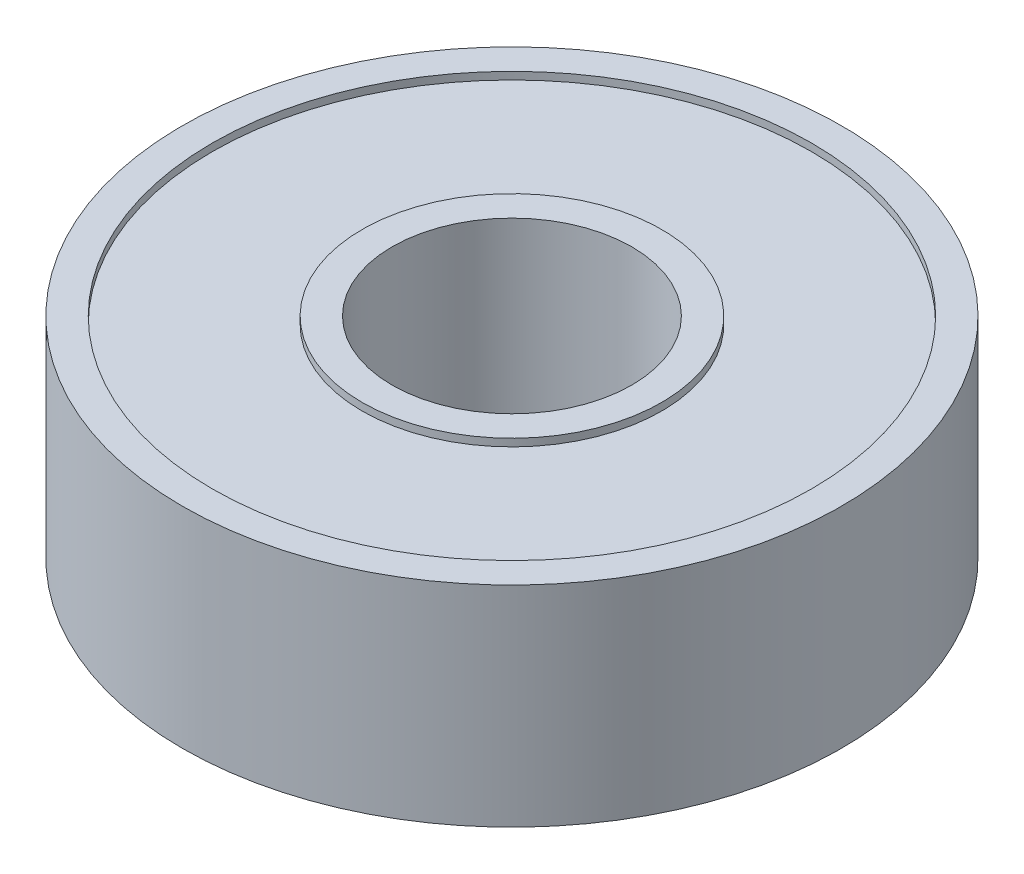
ISO-10303-21;
HEADER;
FILE_DESCRIPTION(('STEP AP214'),'2;1');
FILE_NAME('part.step','',(''),(''),'','','');
FILE_SCHEMA(('AUTOMOTIVE_DESIGN { 1 0 10303 214 1 1 1 1 }'));
ENDSEC;
DATA;
#1=APPLICATION_CONTEXT('core data for automotive mechanical design processes');
#2=APPLICATION_PROTOCOL_DEFINITION('international standard','automotive_design',2000,#1);
#3=PRODUCT_CONTEXT('',#1,'mechanical');
#4=PRODUCT('Part','Part','',(#3));
#5=PRODUCT_RELATED_PRODUCT_CATEGORY('part','',(#4));
#6=PRODUCT_DEFINITION_FORMATION('','',#4);
#7=PRODUCT_DEFINITION_CONTEXT('part definition',#1,'design');
#8=PRODUCT_DEFINITION('design','',#6,#7);
#9=PRODUCT_DEFINITION_SHAPE('','',#8);
#10=(LENGTH_UNIT() NAMED_UNIT(*) SI_UNIT(.MILLI.,.METRE.));
#11=(NAMED_UNIT(*) PLANE_ANGLE_UNIT() SI_UNIT($,.RADIAN.));
#12=(NAMED_UNIT(*) SI_UNIT($,.STERADIAN.) SOLID_ANGLE_UNIT());
#13=UNCERTAINTY_MEASURE_WITH_UNIT(LENGTH_MEASURE(1.E-05),#10,'distance_accuracy_value','');
#14=(GEOMETRIC_REPRESENTATION_CONTEXT(3) GLOBAL_UNCERTAINTY_ASSIGNED_CONTEXT((#13)) GLOBAL_UNIT_ASSIGNED_CONTEXT((#10,
#11,#12)) REPRESENTATION_CONTEXT('',''));
#15=CARTESIAN_POINT('',(0.,0.,0.));
#16=DIRECTION('',(0.,0.,1.));
#17=DIRECTION('',(1.,0.,0.));
#18=AXIS2_PLACEMENT_3D('',#15,#16,#17);
#19=CARTESIAN_POINT('',(0.,0.,0.));
#20=DIRECTION('',(0.,1.,0.));
#21=DIRECTION('',(0.,0.,1.));
#22=AXIS2_PLACEMENT_3D('',#19,#20,#21);
#23=PLANE('',#22);
#24=CARTESIAN_POINT('',(0.,0.,0.));
#25=DIRECTION('',(0.,1.,0.));
#26=DIRECTION('',(0.,0.,1.));
#27=AXIS2_PLACEMENT_3D('',#24,#25,#26);
#28=CIRCLE('',#27,4.);
#29=CARTESIAN_POINT('',(0.,0.,4.));
#30=VERTEX_POINT('',#29);
#31=EDGE_CURVE('E47',#30,#30,#28,.T.);
#32=ORIENTED_EDGE('',*,*,#31,.T.);
#33=EDGE_LOOP('',(#32));
#34=FACE_BOUND('',#33,.T.);
#35=CARTESIAN_POINT('',(0.,0.,0.));
#36=DIRECTION('',(0.,1.,0.));
#37=DIRECTION('',(0.,0.,1.));
#38=AXIS2_PLACEMENT_3D('',#35,#36,#37);
#39=CIRCLE('',#38,5.);
#40=CARTESIAN_POINT('',(0.,0.,5.));
#41=VERTEX_POINT('',#40);
#42=EDGE_CURVE('E71',#41,#41,#39,.T.);
#43=ORIENTED_EDGE('',*,*,#42,.F.);
#44=EDGE_LOOP('',(#43));
#45=FACE_BOUND('',#44,.T.);
#46=ADVANCED_FACE('F34',(#34,#45),#23,.F.);
#47=CARTESIAN_POINT('',(0.,7.,0.));
#48=DIRECTION('',(0.,1.,0.));
#49=DIRECTION('',(0.,0.,1.));
#50=AXIS2_PLACEMENT_3D('',#47,#48,#49);
#51=PLANE('',#50);
#52=CARTESIAN_POINT('',(0.,7.,0.));
#53=DIRECTION('',(0.,1.,0.));
#54=DIRECTION('',(0.,0.,1.));
#55=AXIS2_PLACEMENT_3D('',#52,#53,#54);
#56=CIRCLE('',#55,4.);
#57=CARTESIAN_POINT('',(0.,7.,4.));
#58=VERTEX_POINT('',#57);
#59=EDGE_CURVE('E45',#58,#58,#56,.T.);
#60=ORIENTED_EDGE('',*,*,#59,.F.);
#61=EDGE_LOOP('',(#60));
#62=FACE_BOUND('',#61,.T.);
#63=CARTESIAN_POINT('',(0.,7.,0.));
#64=DIRECTION('',(0.,1.,0.));
#65=DIRECTION('',(0.,0.,1.));
#66=AXIS2_PLACEMENT_3D('',#63,#64,#65);
#67=CIRCLE('',#66,5.);
#68=CARTESIAN_POINT('',(0.,7.,5.));
#69=VERTEX_POINT('',#68);
#70=EDGE_CURVE('E59',#69,#69,#67,.T.);
#71=ORIENTED_EDGE('',*,*,#70,.T.);
#72=EDGE_LOOP('',(#71));
#73=FACE_BOUND('',#72,.T.);
#74=ADVANCED_FACE('F87',(#62,#73),#51,.T.);
#75=CARTESIAN_POINT('',(0.,7.,0.));
#76=DIRECTION('',(0.,1.,0.));
#77=DIRECTION('',(0.,0.,1.));
#78=AXIS2_PLACEMENT_3D('',#75,#76,#77);
#79=CIRCLE('',#78,10.);
#80=CARTESIAN_POINT('',(0.,7.,10.));
#81=VERTEX_POINT('',#80);
#82=EDGE_CURVE('E53',#81,#81,#79,.T.);
#83=ORIENTED_EDGE('',*,*,#82,.F.);
#84=EDGE_LOOP('',(#83));
#85=FACE_BOUND('',#84,.T.);
#86=CARTESIAN_POINT('',(0.,7.,0.));
#87=DIRECTION('',(0.,1.,0.));
#88=DIRECTION('',(0.,0.,1.));
#89=AXIS2_PLACEMENT_3D('',#86,#87,#88);
#90=CIRCLE('',#89,11.);
#91=CARTESIAN_POINT('',(0.,7.,11.));
#92=VERTEX_POINT('',#91);
#93=EDGE_CURVE('E10',#92,#92,#90,.T.);
#94=ORIENTED_EDGE('',*,*,#93,.T.);
#95=EDGE_LOOP('',(#94));
#96=FACE_BOUND('',#95,.T.);
#97=ADVANCED_FACE('F93',(#85,#96),#51,.T.);
#98=CARTESIAN_POINT('',(0.,0.,0.));
#99=DIRECTION('',(0.,1.,0.));
#100=DIRECTION('',(0.,0.,1.));
#101=AXIS2_PLACEMENT_3D('',#98,#99,#100);
#102=CIRCLE('',#101,10.);
#103=CARTESIAN_POINT('',(0.,0.,10.));
#104=VERTEX_POINT('',#103);
#105=EDGE_CURVE('E65',#104,#104,#102,.T.);
#106=ORIENTED_EDGE('',*,*,#105,.T.);
#107=EDGE_LOOP('',(#106));
#108=FACE_BOUND('',#107,.T.);
#109=CARTESIAN_POINT('',(0.,0.,0.));
#110=DIRECTION('',(0.,1.,0.));
#111=DIRECTION('',(0.,0.,1.));
#112=AXIS2_PLACEMENT_3D('',#109,#110,#111);
#113=CIRCLE('',#112,11.);
#114=CARTESIAN_POINT('',(0.,0.,11.));
#115=VERTEX_POINT('',#114);
#116=EDGE_CURVE('E38',#115,#115,#113,.T.);
#117=ORIENTED_EDGE('',*,*,#116,.F.);
#118=EDGE_LOOP('',(#117));
#119=FACE_BOUND('',#118,.T.);
#120=ADVANCED_FACE('F89',(#108,#119),#23,.F.);
#121=CARTESIAN_POINT('',(0.,7.,0.));
#122=DIRECTION('',(0.,-1.,0.));
#123=DIRECTION('',(0.,0.,-1.));
#124=AXIS2_PLACEMENT_3D('',#121,#122,#123);
#125=CYLINDRICAL_SURFACE('',#124,11.);
#126=ORIENTED_EDGE('',*,*,#93,.F.);
#127=EDGE_LOOP('',(#126));
#128=FACE_BOUND('',#127,.T.);
#129=ORIENTED_EDGE('',*,*,#116,.T.);
#130=EDGE_LOOP('',(#129));
#131=FACE_BOUND('',#130,.T.);
#132=ADVANCED_FACE('F36',(#128,#131),#125,.T.);
#133=CARTESIAN_POINT('',(0.,7.,0.));
#134=DIRECTION('',(0.,-1.,0.));
#135=DIRECTION('',(0.,0.,-1.));
#136=AXIS2_PLACEMENT_3D('',#133,#134,#135);
#137=CYLINDRICAL_SURFACE('',#136,4.);
#138=ORIENTED_EDGE('',*,*,#59,.T.);
#139=EDGE_LOOP('',(#138));
#140=FACE_BOUND('',#139,.T.);
#141=ORIENTED_EDGE('',*,*,#31,.F.);
#142=EDGE_LOOP('',(#141));
#143=FACE_BOUND('',#142,.T.);
#144=ADVANCED_FACE('F102',(#140,#143),#137,.F.);
#145=CARTESIAN_POINT('',(0.,6.75,0.));
#146=DIRECTION('',(0.,1.,0.));
#147=DIRECTION('',(0.,0.,1.));
#148=AXIS2_PLACEMENT_3D('',#145,#146,#147);
#149=CYLINDRICAL_SURFACE('',#148,10.);
#150=CARTESIAN_POINT('',(0.,6.75,0.));
#151=DIRECTION('',(0.,1.,0.));
#152=DIRECTION('',(0.,0.,1.));
#153=AXIS2_PLACEMENT_3D('',#150,#151,#152);
#154=CIRCLE('',#153,10.);
#155=CARTESIAN_POINT('',(0.,6.75,10.));
#156=VERTEX_POINT('',#155);
#157=EDGE_CURVE('E50',#156,#156,#154,.T.);
#158=ORIENTED_EDGE('',*,*,#157,.F.);
#159=EDGE_LOOP('',(#158));
#160=FACE_BOUND('',#159,.T.);
#161=ORIENTED_EDGE('',*,*,#82,.T.);
#162=EDGE_LOOP('',(#161));
#163=FACE_BOUND('',#162,.T.);
#164=ADVANCED_FACE('F126',(#160,#163),#149,.F.);
#165=CARTESIAN_POINT('',(0.,6.75,0.));
#166=DIRECTION('',(0.,1.,0.));
#167=DIRECTION('',(0.,0.,1.));
#168=AXIS2_PLACEMENT_3D('',#165,#166,#167);
#169=PLANE('',#168);
#170=CARTESIAN_POINT('',(0.,6.75,0.));
#171=DIRECTION('',(0.,1.,0.));
#172=DIRECTION('',(0.,0.,1.));
#173=AXIS2_PLACEMENT_3D('',#170,#171,#172);
#174=CIRCLE('',#173,5.);
#175=CARTESIAN_POINT('',(0.,6.75,5.));
#176=VERTEX_POINT('',#175);
#177=EDGE_CURVE('E56',#176,#176,#174,.T.);
#178=ORIENTED_EDGE('',*,*,#177,.F.);
#179=EDGE_LOOP('',(#178));
#180=FACE_BOUND('',#179,.T.);
#181=ORIENTED_EDGE('',*,*,#157,.T.);
#182=EDGE_LOOP('',(#181));
#183=FACE_BOUND('',#182,.T.);
#184=ADVANCED_FACE('F122',(#180,#183),#169,.T.);
#185=CARTESIAN_POINT('',(0.,6.75,0.));
#186=DIRECTION('',(0.,1.,0.));
#187=DIRECTION('',(0.,0.,1.));
#188=AXIS2_PLACEMENT_3D('',#185,#186,#187);
#189=CYLINDRICAL_SURFACE('',#188,5.);
#190=ORIENTED_EDGE('',*,*,#177,.T.);
#191=EDGE_LOOP('',(#190));
#192=FACE_BOUND('',#191,.T.);
#193=ORIENTED_EDGE('',*,*,#70,.F.);
#194=EDGE_LOOP('',(#193));
#195=FACE_BOUND('',#194,.T.);
#196=ADVANCED_FACE('F116',(#192,#195),#189,.T.);
#197=CARTESIAN_POINT('',(0.,0.25,0.));
#198=DIRECTION('',(0.,-1.,0.));
#199=DIRECTION('',(0.,0.,1.));
#200=AXIS2_PLACEMENT_3D('',#197,#198,#199);
#201=PLANE('',#200);
#202=CARTESIAN_POINT('',(0.,0.25,0.));
#203=DIRECTION('',(0.,1.,0.));
#204=DIRECTION('',(0.,0.,1.));
#205=AXIS2_PLACEMENT_3D('',#202,#203,#204);
#206=CIRCLE('',#205,10.);
#207=CARTESIAN_POINT('',(0.,0.25,10.));
#208=VERTEX_POINT('',#207);
#209=EDGE_CURVE('E62',#208,#208,#206,.T.);
#210=ORIENTED_EDGE('',*,*,#209,.F.);
#211=EDGE_LOOP('',(#210));
#212=FACE_BOUND('',#211,.T.);
#213=CARTESIAN_POINT('',(0.,0.25,0.));
#214=DIRECTION('',(0.,1.,0.));
#215=DIRECTION('',(0.,0.,1.));
#216=AXIS2_PLACEMENT_3D('',#213,#214,#215);
#217=CIRCLE('',#216,5.);
#218=CARTESIAN_POINT('',(0.,0.25,5.));
#219=VERTEX_POINT('',#218);
#220=EDGE_CURVE('E68',#219,#219,#217,.T.);
#221=ORIENTED_EDGE('',*,*,#220,.T.);
#222=EDGE_LOOP('',(#221));
#223=FACE_BOUND('',#222,.T.);
#224=ADVANCED_FACE('F77',(#212,#223),#201,.T.);
#225=CARTESIAN_POINT('',(0.,0.25,0.));
#226=DIRECTION('',(0.,-1.,0.));
#227=DIRECTION('',(0.,0.,-1.));
#228=AXIS2_PLACEMENT_3D('',#225,#226,#227);
#229=CYLINDRICAL_SURFACE('',#228,10.);
#230=ORIENTED_EDGE('',*,*,#209,.T.);
#231=EDGE_LOOP('',(#230));
#232=FACE_BOUND('',#231,.T.);
#233=ORIENTED_EDGE('',*,*,#105,.F.);
#234=EDGE_LOOP('',(#233));
#235=FACE_BOUND('',#234,.T.);
#236=ADVANCED_FACE('F82',(#232,#235),#229,.F.);
#237=CARTESIAN_POINT('',(0.,0.25,0.));
#238=DIRECTION('',(0.,-1.,0.));
#239=DIRECTION('',(0.,0.,-1.));
#240=AXIS2_PLACEMENT_3D('',#237,#238,#239);
#241=CYLINDRICAL_SURFACE('',#240,5.);
#242=ORIENTED_EDGE('',*,*,#220,.F.);
#243=EDGE_LOOP('',(#242));
#244=FACE_BOUND('',#243,.T.);
#245=ORIENTED_EDGE('',*,*,#42,.T.);
#246=EDGE_LOOP('',(#245));
#247=FACE_BOUND('',#246,.T.);
#248=ADVANCED_FACE('F79',(#244,#247),#241,.T.);
#249=CLOSED_SHELL('',(#46,#74,#97,#120,#132,#144,#164,#184,#196,#224,#236,#248));
#250=MANIFOLD_SOLID_BREP('B2',#249);
#251=ADVANCED_BREP_SHAPE_REPRESENTATION('',(#18,#250),#14);
#252=SHAPE_DEFINITION_REPRESENTATION(#9,#251);
ENDSEC;
END-ISO-10303-21;
